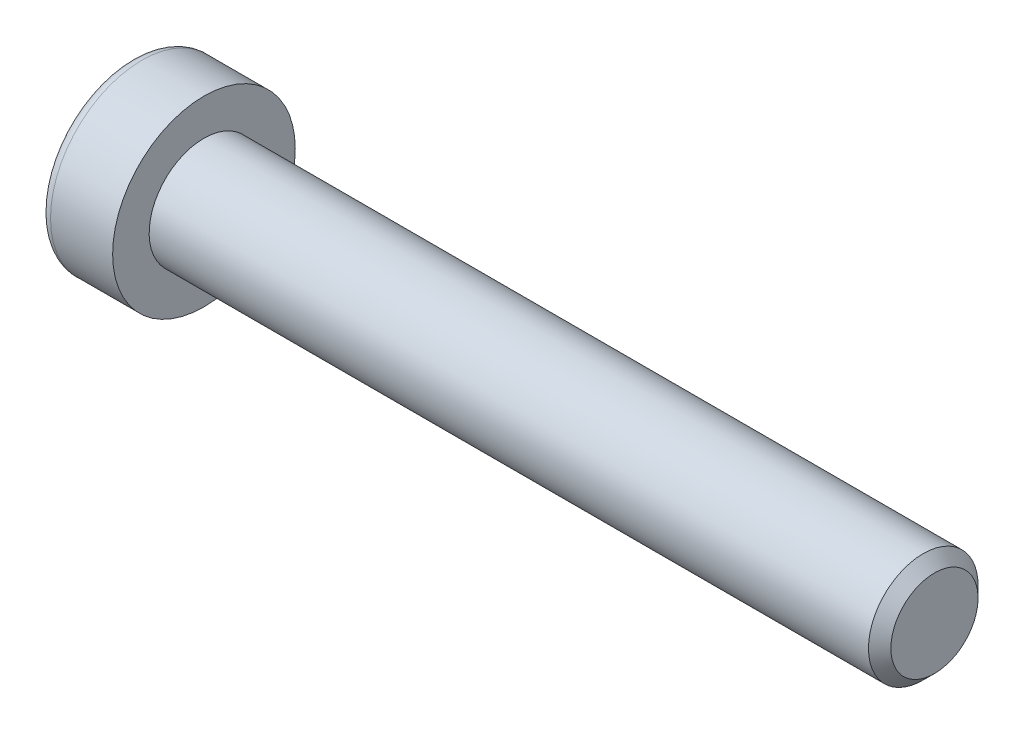
ISO-10303-21;
HEADER;
FILE_DESCRIPTION(('STEP AP214'),'2;1');
FILE_NAME('part.step','',(''),(''),'','','');
FILE_SCHEMA(('AUTOMOTIVE_DESIGN { 1 0 10303 214 1 1 1 1 }'));
ENDSEC;
DATA;
#1=APPLICATION_CONTEXT('core data for automotive mechanical design processes');
#2=APPLICATION_PROTOCOL_DEFINITION('international standard','automotive_design',2000,#1);
#3=PRODUCT_CONTEXT('',#1,'mechanical');
#4=PRODUCT('Part','Part','',(#3));
#5=PRODUCT_RELATED_PRODUCT_CATEGORY('part','',(#4));
#6=PRODUCT_DEFINITION_FORMATION('','',#4);
#7=PRODUCT_DEFINITION_CONTEXT('part definition',#1,'design');
#8=PRODUCT_DEFINITION('design','',#6,#7);
#9=PRODUCT_DEFINITION_SHAPE('','',#8);
#10=(LENGTH_UNIT() NAMED_UNIT(*) SI_UNIT(.MILLI.,.METRE.));
#11=(NAMED_UNIT(*) PLANE_ANGLE_UNIT() SI_UNIT($,.RADIAN.));
#12=(NAMED_UNIT(*) SI_UNIT($,.STERADIAN.) SOLID_ANGLE_UNIT());
#13=UNCERTAINTY_MEASURE_WITH_UNIT(LENGTH_MEASURE(1.E-05),#10,'distance_accuracy_value','');
#14=(GEOMETRIC_REPRESENTATION_CONTEXT(3) GLOBAL_UNCERTAINTY_ASSIGNED_CONTEXT((#13)) GLOBAL_UNIT_ASSIGNED_CONTEXT((#10,
#11,#12)) REPRESENTATION_CONTEXT('',''));
#15=CARTESIAN_POINT('',(0.,0.,0.));
#16=DIRECTION('',(0.,0.,1.));
#17=DIRECTION('',(1.,0.,0.));
#18=AXIS2_PLACEMENT_3D('',#15,#16,#17);
#19=CARTESIAN_POINT('',(-1.0080000013204,0.,0.));
#20=DIRECTION('',(-1.,0.,0.));
#21=DIRECTION('',(0.,0.,1.));
#22=AXIS2_PLACEMENT_3D('',#19,#20,#21);
#23=CONICAL_SURFACE('',#22,2.32325748231688,1.04719754987444);
#24=CARTESIAN_POINT('',(0.333333335277075,-1.13686837721616E-10,0.));
#25=VERTEX_POINT('',#24);
#26=VERTEX_LOOP('',#25);
#27=FACE_BOUND('',#26,.T.);
#28=CARTESIAN_POINT('',(-1.00000000147417,2.00000000033577,1.15470053795369));
#29=CARTESIAN_POINT('',(-0.970695546651424,2.00000000012059,1.05321634683343));
#30=CARTESIAN_POINT('',(-0.944044678605912,2.00000000003232,0.950856145634243));
#31=CARTESIAN_POINT('',(-0.89752638882102,1.9999999999676,0.744363444828041));
#32=CARTESIAN_POINT('',(-0.877675421693126,1.99999999999142,0.640227277439652));
#33=CARTESIAN_POINT('',(-0.846775960221252,2.00000000000837,0.433245449982703));
#34=CARTESIAN_POINT('',(-0.835521788855821,2.00000000000223,0.330431627800687));
#35=CARTESIAN_POINT('',(-0.822089169383493,1.99999999999777,0.124320462828436));
#36=CARTESIAN_POINT('',(-0.819899595237444,1.99999999999944,0.0210238686822163));
#37=CARTESIAN_POINT('',(-0.824466291464269,2.00000000000049,-0.171974735991148));
#38=CARTESIAN_POINT('',(-0.830101286550578,2.00000000000013,-0.261705707531802));
#39=CARTESIAN_POINT('',(-0.847957302108121,1.99999999999987,-0.440583082600117));
#40=CARTESIAN_POINT('',(-0.860184416189506,1.99999999999996,-0.529728867900473));
#41=CARTESIAN_POINT('',(-0.890749834827568,2.00000000000004,-0.70897474722998));
#42=CARTESIAN_POINT('',(-0.909217643745651,2.00000000000002,-0.799052166718215));
#43=CARTESIAN_POINT('',(-0.951131762446776,1.99999999999998,-0.977863889549757));
#44=CARTESIAN_POINT('',(-0.974568230401505,1.99999999999996,-1.06660048191082));
#45=CARTESIAN_POINT('',(-1.0000000016925,2.,-1.15470053794852));
#46=B_SPLINE_CURVE_WITH_KNOTS('',3,(#28,#29,#30,#31,#32,#33,#34,#35,#36,#37,#38,#39,#40,#41,#42,
#43,#44,#45),.UNSPECIFIED.,.F.,.F.,(4,2,2,2,2,2,2,2,4),(0.,0.317016011625951,0.634793817177001,
0.944707606346165,1.25424088912896,1.52370778261223,1.7934241935265,2.06912162198924,
2.3442779727795),.UNSPECIFIED.);
#47=CARTESIAN_POINT('',(-1.00000000167708,1.99999999979036,1.15470053825821));
#48=VERTEX_POINT('',#47);
#49=CARTESIAN_POINT('',(-1.00000000174696,2.,-1.15470053813718));
#50=VERTEX_POINT('',#49);
#51=EDGE_CURVE('E19',#48,#50,#46,.T.);
#52=ORIENTED_EDGE('',*,*,#51,.T.);
#53=CARTESIAN_POINT('',(-1.00000000147417,1.99999999979934,-1.15470053888282));
#54=CARTESIAN_POINT('',(-0.970695546651423,1.91211211209909,-1.2054426342566));
#55=CARTESIAN_POINT('',(-0.944044678605912,1.82346557747997,-1.25662273477975));
#56=CARTESIAN_POINT('',(-0.89752638882102,1.64463765285338,-1.3598690851268));
#57=CARTESIAN_POINT('',(-0.877675421693125,1.5544530864542,-1.41193716884162));
#58=CARTESIAN_POINT('',(-0.846775960221251,1.37520156576323,-1.51542808258477));
#59=CARTESIAN_POINT('',(-0.83552178885582,1.28616218389036,-1.56683499367046));
#60=CARTESIAN_POINT('',(-0.822089169383492,1.10766467901855,-1.66989057615273));
#61=CARTESIAN_POINT('',(-0.819899595237443,1.01820720436435,-1.72153887322728));
#62=CARTESIAN_POINT('',(-0.824466291464268,0.851065509822789,-1.81803817556487));
#63=CARTESIAN_POINT('',(-0.830101286550577,0.773356208962147,-1.86290366133489));
#64=CARTESIAN_POINT('',(-0.84795730210812,0.618443857990577,-1.95234234886882));
#65=CARTESIAN_POINT('',(-0.860184416189505,0.541241343280201,-1.99691524151908));
#66=CARTESIAN_POINT('',(-0.890749834827567,0.386009858257207,-2.0865381811839));
#67=CARTESIAN_POINT('',(-0.90921764374565,0.308000524673037,-2.131576890928));
#68=CARTESIAN_POINT('',(-0.951131762446774,0.153145030206441,-2.22098275234374));
#69=CARTESIAN_POINT('',(-0.974568230401503,0.0762968869764867,-2.26535104852425));
#70=CARTESIAN_POINT('',(-1.0000000016925,3.73024698366476E-10,-2.30940107654314));
#71=B_SPLINE_CURVE_WITH_KNOTS('',3,(#53,#54,#55,#56,#57,#58,#59,#60,#61,#62,#63,#64,#65,#66,#67,
#68,#69,#70),.UNSPECIFIED.,.F.,.F.,(4,2,2,2,2,2,2,2,4),(0.,0.317016011625951,0.634793817177,
0.944707606346164,1.25424088912896,1.52370778261223,1.7934241935265,2.06912162198924,
2.3442779727795),.UNSPECIFIED.);
#72=CARTESIAN_POINT('',(-1.00000000167708,0.,-2.30940107651643));
#73=VERTEX_POINT('',#72);
#74=EDGE_CURVE('E79',#50,#73,#71,.T.);
#75=ORIENTED_EDGE('',*,*,#74,.T.);
#76=CARTESIAN_POINT('',(-1.00000000147417,-5.36430553666362E-10,-2.30940107683651));
#77=CARTESIAN_POINT('',(-0.970695546651424,-0.0878878880215004,-2.25865898109003));
#78=CARTESIAN_POINT('',(-0.944044678605912,-0.176534422552348,-2.20747888041399));
#79=CARTESIAN_POINT('',(-0.89752638882102,-0.355362347114219,-2.10423252995484));
#80=CARTESIAN_POINT('',(-0.877675421693126,-0.445546913537223,-2.05216444628128));
#81=CARTESIAN_POINT('',(-0.846775960221251,-0.624798434245139,-1.94867353256747));
#82=CARTESIAN_POINT('',(-0.83552178885582,-0.713837816111874,-1.89726662147115));
#83=CARTESIAN_POINT('',(-0.822089169383492,-0.89233532097922,-1.79421103898117));
#84=CARTESIAN_POINT('',(-0.819899595237443,-0.981792795635091,-1.7425627419095));
#85=CARTESIAN_POINT('',(-0.824466291464268,-1.1489344901777,-1.64606343957373));
#86=CARTESIAN_POINT('',(-0.830101286550577,-1.22664379103798,-1.60119795380309));
#87=CARTESIAN_POINT('',(-0.84795730210812,-1.38155614200929,-1.51175926626871));
#88=CARTESIAN_POINT('',(-0.860184416189505,-1.45875865671976,-1.46718637361861));
#89=CARTESIAN_POINT('',(-0.890749834827567,-1.61399014174283,-1.37756343395392));
#90=CARTESIAN_POINT('',(-0.90921764374565,-1.69199947532698,-1.33252472420979));
#91=CARTESIAN_POINT('',(-0.951131762446775,-1.84685496979354,-1.24311886279398));
#92=CARTESIAN_POINT('',(-0.974568230401503,-1.92370311302347,-1.19875056661343));
#93=CARTESIAN_POINT('',(-1.0000000016925,-1.99999999962697,-1.15470053859462));
#94=B_SPLINE_CURVE_WITH_KNOTS('',3,(#76,#77,#78,#79,#80,#81,#82,#83,#84,#85,#86,#87,#88,#89,#90,
#91,#92,#93),.UNSPECIFIED.,.F.,.F.,(4,2,2,2,2,2,2,2,4),(0.,0.317016011625951,0.634793817177001,
0.944707606346165,1.25424088912896,1.52370778261223,1.7934241935265,2.06912162198924,
2.3442779727795),.UNSPECIFIED.);
#95=CARTESIAN_POINT('',(-1.00000000167708,-1.99999999979036,-1.15470053825822));
#96=VERTEX_POINT('',#95);
#97=EDGE_CURVE('E104',#73,#96,#94,.T.);
#98=ORIENTED_EDGE('',*,*,#97,.T.);
#99=CARTESIAN_POINT('',(-1.00000000147417,-2.00000000033577,-1.15470053795369));
#100=CARTESIAN_POINT('',(-0.970695546651424,-2.00000000012059,-1.05321634683343));
#101=CARTESIAN_POINT('',(-0.944044678605912,-2.00000000003232,-0.950856145634245));
#102=CARTESIAN_POINT('',(-0.89752638882102,-1.9999999999676,-0.744363444828043));
#103=CARTESIAN_POINT('',(-0.877675421693126,-1.99999999999142,-0.640227277439654));
#104=CARTESIAN_POINT('',(-0.846775960221251,-2.00000000000836,-0.433245449982705));
#105=CARTESIAN_POINT('',(-0.83552178885582,-2.00000000000223,-0.330431627800689));
#106=CARTESIAN_POINT('',(-0.822089169383492,-1.99999999999777,-0.124320462828438));
#107=CARTESIAN_POINT('',(-0.819899595237443,-1.99999999999944,-0.0210238686822187));
#108=CARTESIAN_POINT('',(-0.824466291464268,-2.00000000000049,0.171974735991145));
#109=CARTESIAN_POINT('',(-0.830101286550578,-2.00000000000013,0.261705707531799));
#110=CARTESIAN_POINT('',(-0.84795730210812,-1.99999999999987,0.440583082600114));
#111=CARTESIAN_POINT('',(-0.860184416189505,-1.99999999999996,0.529728867900471));
#112=CARTESIAN_POINT('',(-0.890749834827567,-2.00000000000004,0.708974747229978));
#113=CARTESIAN_POINT('',(-0.90921764374565,-2.00000000000002,0.799052166718213));
#114=CARTESIAN_POINT('',(-0.951131762446775,-1.99999999999998,0.977863889549755));
#115=CARTESIAN_POINT('',(-0.974568230401504,-1.99999999999996,1.06660048191082));
#116=CARTESIAN_POINT('',(-1.0000000016925,-2.,1.15470053794852));
#117=B_SPLINE_CURVE_WITH_KNOTS('',3,(#99,#100,#101,#102,#103,#104,#105,#106,#107,#108,#109,#110,
#111,#112,#113,#114,#115,#116),.UNSPECIFIED.,.F.,.F.,(4,2,2,2,2,2,2,2,4),(0.,0.317016011625951,
0.634793817177001,0.944707606346165,1.25424088912896,1.52370778261223,1.7934241935265,
2.06912162198924,2.3442779727795),.UNSPECIFIED.);
#118=CARTESIAN_POINT('',(-1.00000000167708,-1.99999999979036,1.15470053825822));
#119=VERTEX_POINT('',#118);
#120=EDGE_CURVE('E128',#96,#119,#117,.T.);
#121=ORIENTED_EDGE('',*,*,#120,.T.);
#122=CARTESIAN_POINT('',(-1.00000000147417,-1.99999999979934,1.15470053888282));
#123=CARTESIAN_POINT('',(-0.970695546651424,-1.91211211209909,1.2054426342566));
#124=CARTESIAN_POINT('',(-0.944044678605912,-1.82346557747997,1.25662273477974));
#125=CARTESIAN_POINT('',(-0.89752638882102,-1.64463765285338,1.3598690851268));
#126=CARTESIAN_POINT('',(-0.877675421693125,-1.5544530864542,1.41193716884162));
#127=CARTESIAN_POINT('',(-0.846775960221251,-1.37520156576323,1.51542808258477));
#128=CARTESIAN_POINT('',(-0.83552178885582,-1.28616218389036,1.56683499367046));
#129=CARTESIAN_POINT('',(-0.822089169383492,-1.10766467901855,1.66989057615273));
#130=CARTESIAN_POINT('',(-0.819899595237443,-1.01820720436435,1.72153887322728));
#131=CARTESIAN_POINT('',(-0.824466291464268,-0.85106550982279,1.81803817556487));
#132=CARTESIAN_POINT('',(-0.830101286550577,-0.773356208962147,1.86290366133489));
#133=CARTESIAN_POINT('',(-0.84795730210812,-0.618443857990578,1.95234234886882));
#134=CARTESIAN_POINT('',(-0.860184416189505,-0.541241343280202,1.99691524151908));
#135=CARTESIAN_POINT('',(-0.890749834827567,-0.386009858257207,2.0865381811839));
#136=CARTESIAN_POINT('',(-0.90921764374565,-0.308000524673038,2.131576890928));
#137=CARTESIAN_POINT('',(-0.951131762446775,-0.153145030206442,2.22098275234374));
#138=CARTESIAN_POINT('',(-0.974568230401503,-0.0762968869764879,2.26535104852425));
#139=CARTESIAN_POINT('',(-1.0000000016925,-3.73025682950192E-10,2.30940107654314));
#140=B_SPLINE_CURVE_WITH_KNOTS('',3,(#122,#123,#124,#125,#126,#127,#128,#129,#130,#131,#132,
#133,#134,#135,#136,#137,#138,#139),.UNSPECIFIED.,.F.,.F.,(4,2,2,2,2,2,2,2,4),(0.,
0.317016011625951,0.634793817177001,0.944707606346165,1.25424088912896,1.52370778261223,
1.7934241935265,2.06912162198924,2.3442779727795),.UNSPECIFIED.);
#141=CARTESIAN_POINT('',(-1.00000000167708,0.,2.30940107651643));
#142=VERTEX_POINT('',#141);
#143=EDGE_CURVE('E136',#119,#142,#140,.T.);
#144=ORIENTED_EDGE('',*,*,#143,.T.);
#145=CARTESIAN_POINT('',(-1.00000000147417,5.36430323788756E-10,2.30940107683651));
#146=CARTESIAN_POINT('',(-0.970695546651424,0.0878878880215003,2.25865898109003));
#147=CARTESIAN_POINT('',(-0.944044678605912,0.176534422552348,2.20747888041399));
#148=CARTESIAN_POINT('',(-0.89752638882102,0.355362347114218,2.10423252995484));
#149=CARTESIAN_POINT('',(-0.877675421693125,0.445546913537223,2.05216444628128));
#150=CARTESIAN_POINT('',(-0.846775960221251,0.624798434245139,1.94867353256747));
#151=CARTESIAN_POINT('',(-0.83552178885582,0.713837816111873,1.89726662147115));
#152=CARTESIAN_POINT('',(-0.822089169383491,0.892335320979219,1.79421103898117));
#153=CARTESIAN_POINT('',(-0.819899595237443,0.98179279563509,1.7425627419095));
#154=CARTESIAN_POINT('',(-0.824466291464268,1.1489344901777,1.64606343957372));
#155=CARTESIAN_POINT('',(-0.830101286550577,1.22664379103798,1.60119795380309));
#156=CARTESIAN_POINT('',(-0.847957302108119,1.38155614200929,1.5117592662687));
#157=CARTESIAN_POINT('',(-0.860184416189504,1.45875865671976,1.46718637361861));
#158=CARTESIAN_POINT('',(-0.890749834827566,1.61399014174283,1.37756343395392));
#159=CARTESIAN_POINT('',(-0.909217643745649,1.69199947532698,1.33252472420978));
#160=CARTESIAN_POINT('',(-0.951131762446774,1.84685496979354,1.24311886279398));
#161=CARTESIAN_POINT('',(-0.974568230401503,1.92370311302347,1.19875056661343));
#162=CARTESIAN_POINT('',(-1.0000000016925,1.99999999962697,1.15470053859461));
#163=B_SPLINE_CURVE_WITH_KNOTS('',3,(#145,#146,#147,#148,#149,#150,#151,#152,#153,#154,#155,
#156,#157,#158,#159,#160,#161,#162),.UNSPECIFIED.,.F.,.F.,(4,2,2,2,2,2,2,2,4),(0.,
0.317016011625951,0.634793817177001,0.944707606346165,1.25424088912896,1.52370778261223,
1.7934241935265,2.06912162198924,2.3442779727795),.UNSPECIFIED.);
#164=EDGE_CURVE('E81',#142,#48,#163,.T.);
#165=ORIENTED_EDGE('',*,*,#164,.T.);
#166=EDGE_LOOP('',(#52,#75,#98,#121,#144,#165));
#167=FACE_BOUND('',#166,.T.);
#168=ADVANCED_FACE('F15',(#27,#167),#23,.F.);
#169=CARTESIAN_POINT('',(-3.99999999999999,2.,1.15470053837925));
#170=DIRECTION('',(0.,1.,0.));
#171=DIRECTION('',(0.,0.,1.));
#172=AXIS2_PLACEMENT_3D('',#169,#170,#171);
#173=PLANE('',#172);
#174=DIRECTION('',(1.,0.,0.));
#175=VECTOR('',#174,1.);
#176=CARTESIAN_POINT('',(-3.99999999999999,2.,1.15470053837925));
#177=LINE('',#176,#175);
#178=CARTESIAN_POINT('',(-3.99999999999999,2.,1.15470053837925));
#179=VERTEX_POINT('',#178);
#180=EDGE_CURVE('E83',#48,#179,#177,.F.);
#181=ORIENTED_EDGE('',*,*,#180,.T.);
#182=DIRECTION('',(0.,0.,1.));
#183=VECTOR('',#182,1.);
#184=CARTESIAN_POINT('',(-3.99999999999999,2.,0.));
#185=LINE('',#184,#183);
#186=CARTESIAN_POINT('',(-3.99999999999999,2.,-1.15470053837925));
#187=VERTEX_POINT('',#186);
#188=EDGE_CURVE('E88',#187,#179,#185,.T.);
#189=ORIENTED_EDGE('',*,*,#188,.F.);
#190=DIRECTION('',(1.,0.,0.));
#191=VECTOR('',#190,1.);
#192=CARTESIAN_POINT('',(-3.99999999999999,2.,-1.15470053837925));
#193=LINE('',#192,#191);
#194=EDGE_CURVE('E86',#187,#50,#193,.T.);
#195=ORIENTED_EDGE('',*,*,#194,.T.);
#196=ORIENTED_EDGE('',*,*,#51,.F.);
#197=EDGE_LOOP('',(#181,#189,#195,#196));
#198=FACE_BOUND('',#197,.T.);
#199=ADVANCED_FACE('F75',(#198),#173,.F.);
#200=CARTESIAN_POINT('',(-3.99999999999999,0.,2.3094010767585));
#201=DIRECTION('',(0.,0.500000000000001,0.866025403784438));
#202=DIRECTION('',(0.,-0.866025403784438,0.500000000000001));
#203=AXIS2_PLACEMENT_3D('',#200,#201,#202);
#204=PLANE('',#203);
#205=DIRECTION('',(1.,0.,0.));
#206=VECTOR('',#205,1.);
#207=CARTESIAN_POINT('',(-3.99999999999999,0.,2.3094010767585));
#208=LINE('',#207,#206);
#209=CARTESIAN_POINT('',(-3.99999999999999,0.,2.3094010767585));
#210=VERTEX_POINT('',#209);
#211=EDGE_CURVE('E140',#142,#210,#208,.F.);
#212=ORIENTED_EDGE('',*,*,#211,.T.);
#213=DIRECTION('',(0.,-0.866025403784438,0.500000000000001));
#214=VECTOR('',#213,1.);
#215=CARTESIAN_POINT('',(-3.99999999999999,2.,1.15470053837925));
#216=LINE('',#215,#214);
#217=EDGE_CURVE('E94',#179,#210,#216,.T.);
#218=ORIENTED_EDGE('',*,*,#217,.F.);
#219=ORIENTED_EDGE('',*,*,#180,.F.);
#220=ORIENTED_EDGE('',*,*,#164,.F.);
#221=EDGE_LOOP('',(#212,#218,#219,#220));
#222=FACE_BOUND('',#221,.T.);
#223=ADVANCED_FACE('F144',(#222),#204,.F.);
#224=CARTESIAN_POINT('',(-3.99999999999999,-2.,1.15470053837925));
#225=DIRECTION('',(0.,-0.5,0.866025403784439));
#226=DIRECTION('',(0.,-0.866025403784439,-0.5));
#227=AXIS2_PLACEMENT_3D('',#224,#225,#226);
#228=PLANE('',#227);
#229=DIRECTION('',(1.,0.,0.));
#230=VECTOR('',#229,1.);
#231=CARTESIAN_POINT('',(-3.99999999999999,-2.,1.15470053837925));
#232=LINE('',#231,#230);
#233=CARTESIAN_POINT('',(-3.99999999999999,-2.,1.15470053837925));
#234=VERTEX_POINT('',#233);
#235=EDGE_CURVE('E135',#119,#234,#232,.F.);
#236=ORIENTED_EDGE('',*,*,#235,.T.);
#237=DIRECTION('',(0.,-0.866025403784439,-0.5));
#238=VECTOR('',#237,1.);
#239=CARTESIAN_POINT('',(-3.99999999999999,0.,2.3094010767585));
#240=LINE('',#239,#238);
#241=EDGE_CURVE('E223',#210,#234,#240,.T.);
#242=ORIENTED_EDGE('',*,*,#241,.F.);
#243=ORIENTED_EDGE('',*,*,#211,.F.);
#244=ORIENTED_EDGE('',*,*,#143,.F.);
#245=EDGE_LOOP('',(#236,#242,#243,#244));
#246=FACE_BOUND('',#245,.T.);
#247=ADVANCED_FACE('F124',(#246),#228,.F.);
#248=CARTESIAN_POINT('',(-3.99999999999999,-2.,-1.15470053837925));
#249=DIRECTION('',(0.,-1.,0.));
#250=DIRECTION('',(0.,0.,-1.));
#251=AXIS2_PLACEMENT_3D('',#248,#249,#250);
#252=PLANE('',#251);
#253=DIRECTION('',(1.,0.,0.));
#254=VECTOR('',#253,1.);
#255=CARTESIAN_POINT('',(-3.99999999999999,-2.,-1.15470053837925));
#256=LINE('',#255,#254);
#257=CARTESIAN_POINT('',(-3.99999999999999,-2.,-1.15470053837925));
#258=VERTEX_POINT('',#257);
#259=EDGE_CURVE('E134',#96,#258,#256,.F.);
#260=ORIENTED_EDGE('',*,*,#259,.T.);
#261=DIRECTION('',(0.,0.,1.));
#262=VECTOR('',#261,1.);
#263=CARTESIAN_POINT('',(-3.99999999999999,-2.,0.));
#264=LINE('',#263,#262);
#265=EDGE_CURVE('E220',#234,#258,#264,.F.);
#266=ORIENTED_EDGE('',*,*,#265,.F.);
#267=ORIENTED_EDGE('',*,*,#235,.F.);
#268=ORIENTED_EDGE('',*,*,#120,.F.);
#269=EDGE_LOOP('',(#260,#266,#267,#268));
#270=FACE_BOUND('',#269,.T.);
#271=ADVANCED_FACE('F120',(#270),#252,.F.);
#272=CARTESIAN_POINT('',(-3.99999999999999,0.,-2.3094010767585));
#273=DIRECTION('',(0.,-0.5,-0.866025403784438));
#274=DIRECTION('',(0.,0.866025403784438,-0.5));
#275=AXIS2_PLACEMENT_3D('',#272,#273,#274);
#276=PLANE('',#275);
#277=DIRECTION('',(1.,0.,0.));
#278=VECTOR('',#277,1.);
#279=CARTESIAN_POINT('',(-3.99999999999999,0.,-2.3094010767585));
#280=LINE('',#279,#278);
#281=CARTESIAN_POINT('',(-3.99999999999999,0.,-2.3094010767585));
#282=VERTEX_POINT('',#281);
#283=EDGE_CURVE('E37',#73,#282,#280,.F.);
#284=ORIENTED_EDGE('',*,*,#283,.T.);
#285=DIRECTION('',(0.,0.866025403784438,-0.5));
#286=VECTOR('',#285,1.);
#287=CARTESIAN_POINT('',(-3.99999999999999,-2.,-1.15470053837925));
#288=LINE('',#287,#286);
#289=EDGE_CURVE('E217',#258,#282,#288,.T.);
#290=ORIENTED_EDGE('',*,*,#289,.F.);
#291=ORIENTED_EDGE('',*,*,#259,.F.);
#292=ORIENTED_EDGE('',*,*,#97,.F.);
#293=EDGE_LOOP('',(#284,#290,#291,#292));
#294=FACE_BOUND('',#293,.T.);
#295=ADVANCED_FACE('F114',(#294),#276,.F.);
#296=CARTESIAN_POINT('',(-3.99999999999999,2.,-1.15470053837925));
#297=DIRECTION('',(0.,0.5,-0.866025403784439));
#298=DIRECTION('',(0.,0.866025403784439,0.5));
#299=AXIS2_PLACEMENT_3D('',#296,#297,#298);
#300=PLANE('',#299);
#301=ORIENTED_EDGE('',*,*,#194,.F.);
#302=DIRECTION('',(0.,0.866025403784439,0.5));
#303=VECTOR('',#302,1.);
#304=CARTESIAN_POINT('',(-3.99999999999999,0.,-2.3094010767585));
#305=LINE('',#304,#303);
#306=EDGE_CURVE('E215',#282,#187,#305,.T.);
#307=ORIENTED_EDGE('',*,*,#306,.F.);
#308=ORIENTED_EDGE('',*,*,#283,.F.);
#309=ORIENTED_EDGE('',*,*,#74,.F.);
#310=EDGE_LOOP('',(#301,#307,#308,#309));
#311=FACE_BOUND('',#310,.T.);
#312=ADVANCED_FACE('F92',(#311),#300,.F.);
#313=CARTESIAN_POINT('',(-3.99999999999999,3.65470053837925,0.));
#314=DIRECTION('',(-1.,0.,0.));
#315=DIRECTION('',(0.,0.,1.));
#316=AXIS2_PLACEMENT_3D('',#313,#314,#315);
#317=PLANE('',#316);
#318=ORIENTED_EDGE('',*,*,#289,.T.);
#319=ORIENTED_EDGE('',*,*,#306,.T.);
#320=ORIENTED_EDGE('',*,*,#188,.T.);
#321=ORIENTED_EDGE('',*,*,#217,.T.);
#322=ORIENTED_EDGE('',*,*,#241,.T.);
#323=ORIENTED_EDGE('',*,*,#265,.T.);
#324=EDGE_LOOP('',(#318,#319,#320,#321,#322,#323));
#325=FACE_BOUND('',#324,.T.);
#326=CARTESIAN_POINT('',(-3.99999999999999,0.,0.));
#327=DIRECTION('',(1.,0.,0.));
#328=DIRECTION('',(0.,1.,0.));
#329=AXIS2_PLACEMENT_3D('',#326,#327,#328);
#330=CIRCLE('',#329,4.4);
#331=CARTESIAN_POINT('',(-3.99999999999999,4.4,0.));
#332=VERTEX_POINT('',#331);
#333=EDGE_CURVE('E192',#332,#332,#330,.T.);
#334=ORIENTED_EDGE('',*,*,#333,.F.);
#335=EDGE_LOOP('',(#334));
#336=FACE_BOUND('',#335,.T.);
#337=ADVANCED_FACE('F113',(#325,#336),#317,.T.);
#338=CARTESIAN_POINT('',(-3.4,0.,0.));
#339=DIRECTION('',(1.,0.,0.));
#340=DIRECTION('',(0.,0.,-1.));
#341=AXIS2_PLACEMENT_3D('',#338,#339,#340);
#342=TOROIDAL_SURFACE('',#341,4.4,0.6);
#343=CARTESIAN_POINT('',(-3.4,0.,0.));
#344=DIRECTION('',(1.,0.,0.));
#345=DIRECTION('',(0.,1.,0.));
#346=AXIS2_PLACEMENT_3D('',#343,#344,#345);
#347=CIRCLE('',#346,5.);
#348=CARTESIAN_POINT('',(-3.4,5.,0.));
#349=VERTEX_POINT('',#348);
#350=EDGE_CURVE('E233',#349,#349,#347,.T.);
#351=ORIENTED_EDGE('',*,*,#350,.F.);
#352=EDGE_LOOP('',(#351));
#353=FACE_BOUND('',#352,.T.);
#354=ORIENTED_EDGE('',*,*,#333,.T.);
#355=EDGE_LOOP('',(#354));
#356=FACE_BOUND('',#355,.T.);
#357=ADVANCED_FACE('F176',(#353,#356),#342,.T.);
#358=CARTESIAN_POINT('',(-1.99999999999999,0.,0.));
#359=DIRECTION('',(1.,0.,0.));
#360=DIRECTION('',(0.,1.,0.));
#361=AXIS2_PLACEMENT_3D('',#358,#359,#360);
#362=CYLINDRICAL_SURFACE('',#361,5.);
#363=ORIENTED_EDGE('',*,*,#350,.T.);
#364=EDGE_LOOP('',(#363));
#365=FACE_BOUND('',#364,.T.);
#366=CARTESIAN_POINT('',(0.,0.,0.));
#367=DIRECTION('',(1.,0.,0.));
#368=DIRECTION('',(0.,1.,0.));
#369=AXIS2_PLACEMENT_3D('',#366,#367,#368);
#370=CIRCLE('',#369,5.);
#371=CARTESIAN_POINT('',(0.,5.,0.));
#372=VERTEX_POINT('',#371);
#373=EDGE_CURVE('E102',#372,#372,#370,.T.);
#374=ORIENTED_EDGE('',*,*,#373,.F.);
#375=EDGE_LOOP('',(#374));
#376=FACE_BOUND('',#375,.T.);
#377=ADVANCED_FACE('F173',(#365,#376),#362,.T.);
#378=CARTESIAN_POINT('',(40.,1.5,0.));
#379=DIRECTION('',(1.,0.,0.));
#380=DIRECTION('',(0.,0.,-1.));
#381=AXIS2_PLACEMENT_3D('',#378,#379,#380);
#382=PLANE('',#381);
#383=CARTESIAN_POINT('',(40.0000000003047,0.,0.));
#384=DIRECTION('',(-1.,0.,0.));
#385=DIRECTION('',(0.,0.,1.));
#386=AXIS2_PLACEMENT_3D('',#383,#384,#385);
#387=CIRCLE('',#386,2.38655000032395);
#388=CARTESIAN_POINT('',(40.0000000003047,0.,2.38655000032395));
#389=VERTEX_POINT('',#388);
#390=EDGE_CURVE('E229',#389,#389,#387,.T.);
#391=ORIENTED_EDGE('',*,*,#390,.F.);
#392=EDGE_LOOP('',(#391));
#393=FACE_BOUND('',#392,.T.);
#394=ADVANCED_FACE('F169',(#393),#382,.T.);
#395=CARTESIAN_POINT('',(0.,4.,0.));
#396=DIRECTION('',(1.,0.,0.));
#397=DIRECTION('',(0.,0.,-1.));
#398=AXIS2_PLACEMENT_3D('',#395,#396,#397);
#399=PLANE('',#398);
#400=CARTESIAN_POINT('',(0.,0.,0.));
#401=DIRECTION('',(1.,0.,0.));
#402=DIRECTION('',(0.,1.,0.));
#403=AXIS2_PLACEMENT_3D('',#400,#401,#402);
#404=CIRCLE('',#403,3.);
#405=CARTESIAN_POINT('',(0.,3.,0.));
#406=VERTEX_POINT('',#405);
#407=EDGE_CURVE('E28',#406,#406,#404,.T.);
#408=ORIENTED_EDGE('',*,*,#407,.F.);
#409=EDGE_LOOP('',(#408));
#410=FACE_BOUND('',#409,.T.);
#411=ORIENTED_EDGE('',*,*,#373,.T.);
#412=EDGE_LOOP('',(#411));
#413=FACE_BOUND('',#412,.T.);
#414=ADVANCED_FACE('F162',(#410,#413),#399,.T.);
#415=CARTESIAN_POINT('',(39.3865499997901,0.,0.));
#416=DIRECTION('',(-1.,0.,0.));
#417=DIRECTION('',(0.,0.,1.));
#418=AXIS2_PLACEMENT_3D('',#415,#416,#417);
#419=CONICAL_SURFACE('',#418,2.99999999964484,0.785398162424499);
#420=ORIENTED_EDGE('',*,*,#390,.T.);
#421=EDGE_LOOP('',(#420));
#422=FACE_BOUND('',#421,.T.);
#423=CARTESIAN_POINT('',(39.38655,0.,0.));
#424=DIRECTION('',(1.,0.,0.));
#425=DIRECTION('',(0.,1.,0.));
#426=AXIS2_PLACEMENT_3D('',#423,#424,#425);
#427=CIRCLE('',#426,3.);
#428=CARTESIAN_POINT('',(39.38655,3.,0.));
#429=VERTEX_POINT('',#428);
#430=EDGE_CURVE('E10',#429,#429,#427,.F.);
#431=ORIENTED_EDGE('',*,*,#430,.F.);
#432=EDGE_LOOP('',(#431));
#433=FACE_BOUND('',#432,.T.);
#434=ADVANCED_FACE('F155',(#422,#433),#419,.T.);
#435=CARTESIAN_POINT('',(31.,0.,0.));
#436=DIRECTION('',(1.,0.,0.));
#437=DIRECTION('',(0.,1.,0.));
#438=AXIS2_PLACEMENT_3D('',#435,#436,#437);
#439=CYLINDRICAL_SURFACE('',#438,3.);
#440=ORIENTED_EDGE('',*,*,#430,.T.);
#441=EDGE_LOOP('',(#440));
#442=FACE_BOUND('',#441,.T.);
#443=ORIENTED_EDGE('',*,*,#407,.T.);
#444=EDGE_LOOP('',(#443));
#445=FACE_BOUND('',#444,.T.);
#446=ADVANCED_FACE('F153',(#442,#445),#439,.T.);
#447=CLOSED_SHELL('',(#168,#199,#223,#247,#271,#295,#312,#337,#357,#377,#394,#414,#434,#446));
#448=MANIFOLD_SOLID_BREP('B1',#447);
#449=ADVANCED_BREP_SHAPE_REPRESENTATION('',(#18,#448),#14);
#450=SHAPE_DEFINITION_REPRESENTATION(#9,#449);
ENDSEC;
END-ISO-10303-21;
